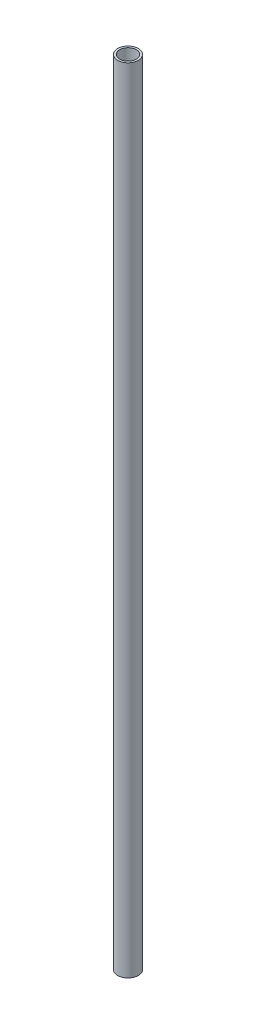
ISO-10303-21;
HEADER;
FILE_DESCRIPTION(('STEP AP214'),'2;1');
FILE_NAME('part.step','',(''),(''),'','','');
FILE_SCHEMA(('AUTOMOTIVE_DESIGN { 1 0 10303 214 1 1 1 1 }'));
ENDSEC;
DATA;
#1=APPLICATION_CONTEXT('core data for automotive mechanical design processes');
#2=APPLICATION_PROTOCOL_DEFINITION('international standard','automotive_design',2000,#1);
#3=PRODUCT_CONTEXT('',#1,'mechanical');
#4=PRODUCT('Part','Part','',(#3));
#5=PRODUCT_RELATED_PRODUCT_CATEGORY('part','',(#4));
#6=PRODUCT_DEFINITION_FORMATION('','',#4);
#7=PRODUCT_DEFINITION_CONTEXT('part definition',#1,'design');
#8=PRODUCT_DEFINITION('design','',#6,#7);
#9=PRODUCT_DEFINITION_SHAPE('','',#8);
#10=(LENGTH_UNIT() NAMED_UNIT(*) SI_UNIT(.MILLI.,.METRE.));
#11=(NAMED_UNIT(*) PLANE_ANGLE_UNIT() SI_UNIT($,.RADIAN.));
#12=(NAMED_UNIT(*) SI_UNIT($,.STERADIAN.) SOLID_ANGLE_UNIT());
#13=UNCERTAINTY_MEASURE_WITH_UNIT(LENGTH_MEASURE(1.E-05),#10,'distance_accuracy_value','');
#14=(GEOMETRIC_REPRESENTATION_CONTEXT(3) GLOBAL_UNCERTAINTY_ASSIGNED_CONTEXT((#13)) GLOBAL_UNIT_ASSIGNED_CONTEXT((#10,
#11,#12)) REPRESENTATION_CONTEXT('',''));
#15=CARTESIAN_POINT('',(0.,0.,0.));
#16=DIRECTION('',(0.,0.,1.));
#17=DIRECTION('',(1.,0.,0.));
#18=AXIS2_PLACEMENT_3D('',#15,#16,#17);
#19=CARTESIAN_POINT('',(0.,487.3625,0.));
#20=DIRECTION('',(0.,-1.,0.));
#21=DIRECTION('',(0.,0.,-1.));
#22=AXIS2_PLACEMENT_3D('',#19,#20,#21);
#23=CYLINDRICAL_SURFACE('',#22,10.16);
#24=CARTESIAN_POINT('',(0.,-487.3625,0.));
#25=DIRECTION('',(0.,-1.,0.));
#26=DIRECTION('',(0.,0.,-1.));
#27=AXIS2_PLACEMENT_3D('',#24,#25,#26);
#28=CIRCLE('',#27,10.16);
#29=CARTESIAN_POINT('',(0.,-487.3625,-10.16));
#30=VERTEX_POINT('',#29);
#31=EDGE_CURVE('E19',#30,#30,#28,.T.);
#32=ORIENTED_EDGE('',*,*,#31,.T.);
#33=EDGE_LOOP('',(#32));
#34=FACE_BOUND('',#33,.T.);
#35=CARTESIAN_POINT('',(0.,487.3625,0.));
#36=DIRECTION('',(0.,-1.,0.));
#37=DIRECTION('',(0.,0.,-1.));
#38=AXIS2_PLACEMENT_3D('',#35,#36,#37);
#39=CIRCLE('',#38,10.16);
#40=CARTESIAN_POINT('',(0.,487.3625,-10.16));
#41=VERTEX_POINT('',#40);
#42=EDGE_CURVE('E28',#41,#41,#39,.T.);
#43=ORIENTED_EDGE('',*,*,#42,.F.);
#44=EDGE_LOOP('',(#43));
#45=FACE_BOUND('',#44,.T.);
#46=ADVANCED_FACE('F15',(#34,#45),#23,.F.);
#47=CARTESIAN_POINT('',(-12.8524,-487.3625,-12.8524));
#48=DIRECTION('',(0.,1.,0.));
#49=DIRECTION('',(0.,0.,1.));
#50=AXIS2_PLACEMENT_3D('',#47,#48,#49);
#51=PLANE('',#50);
#52=ORIENTED_EDGE('',*,*,#31,.F.);
#53=EDGE_LOOP('',(#52));
#54=FACE_BOUND('',#53,.T.);
#55=CARTESIAN_POINT('',(0.,-487.3625,0.));
#56=DIRECTION('',(0.,-1.,0.));
#57=DIRECTION('',(0.,0.,-1.));
#58=AXIS2_PLACEMENT_3D('',#55,#56,#57);
#59=CIRCLE('',#58,12.7);
#60=CARTESIAN_POINT('',(0.,-487.3625,-12.7));
#61=VERTEX_POINT('',#60);
#62=EDGE_CURVE('E23',#61,#61,#59,.T.);
#63=ORIENTED_EDGE('',*,*,#62,.T.);
#64=EDGE_LOOP('',(#63));
#65=FACE_BOUND('',#64,.T.);
#66=ADVANCED_FACE('F38',(#54,#65),#51,.F.);
#67=CARTESIAN_POINT('',(-12.8524,487.3625,-12.8524));
#68=DIRECTION('',(0.,1.,0.));
#69=DIRECTION('',(0.,0.,1.));
#70=AXIS2_PLACEMENT_3D('',#67,#68,#69);
#71=PLANE('',#70);
#72=ORIENTED_EDGE('',*,*,#42,.T.);
#73=EDGE_LOOP('',(#72));
#74=FACE_BOUND('',#73,.T.);
#75=CARTESIAN_POINT('',(0.,487.3625,0.));
#76=DIRECTION('',(0.,-1.,0.));
#77=DIRECTION('',(0.,0.,-1.));
#78=AXIS2_PLACEMENT_3D('',#75,#76,#77);
#79=CIRCLE('',#78,12.7);
#80=CARTESIAN_POINT('',(0.,487.3625,-12.7));
#81=VERTEX_POINT('',#80);
#82=EDGE_CURVE('E10',#81,#81,#79,.F.);
#83=ORIENTED_EDGE('',*,*,#82,.T.);
#84=EDGE_LOOP('',(#83));
#85=FACE_BOUND('',#84,.T.);
#86=ADVANCED_FACE('F17',(#74,#85),#71,.T.);
#87=CARTESIAN_POINT('',(0.,487.3625,0.));
#88=DIRECTION('',(0.,-1.,0.));
#89=DIRECTION('',(0.,0.,-1.));
#90=AXIS2_PLACEMENT_3D('',#87,#88,#89);
#91=CYLINDRICAL_SURFACE('',#90,12.7);
#92=ORIENTED_EDGE('',*,*,#62,.F.);
#93=EDGE_LOOP('',(#92));
#94=FACE_BOUND('',#93,.T.);
#95=ORIENTED_EDGE('',*,*,#82,.F.);
#96=EDGE_LOOP('',(#95));
#97=FACE_BOUND('',#96,.T.);
#98=ADVANCED_FACE('F43',(#94,#97),#91,.T.);
#99=CLOSED_SHELL('',(#46,#66,#86,#98));
#100=MANIFOLD_SOLID_BREP('B1',#99);
#101=ADVANCED_BREP_SHAPE_REPRESENTATION('',(#18,#100),#14);
#102=SHAPE_DEFINITION_REPRESENTATION(#9,#101);
ENDSEC;
END-ISO-10303-21;
